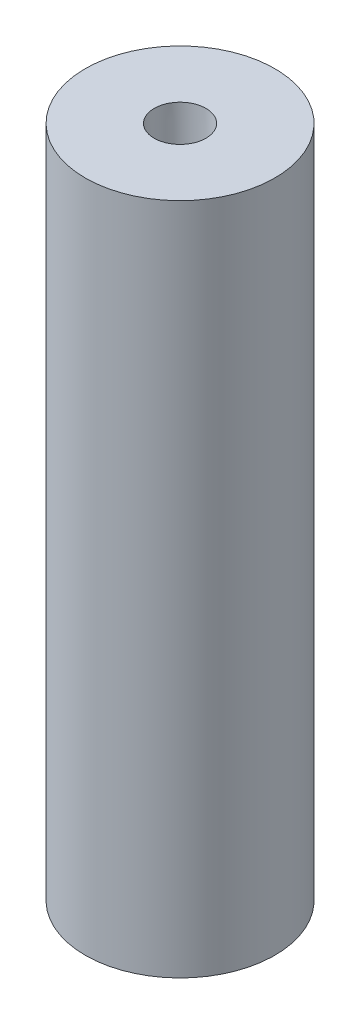
ISO-10303-21;
HEADER;
FILE_DESCRIPTION(('STEP AP214'),'2;1');
FILE_NAME('part.step','',(''),(''),'','','');
FILE_SCHEMA(('AUTOMOTIVE_DESIGN { 1 0 10303 214 1 1 1 1 }'));
ENDSEC;
DATA;
#1=APPLICATION_CONTEXT('core data for automotive mechanical design processes');
#2=APPLICATION_PROTOCOL_DEFINITION('international standard','automotive_design',2000,#1);
#3=PRODUCT_CONTEXT('',#1,'mechanical');
#4=PRODUCT('Part','Part','',(#3));
#5=PRODUCT_RELATED_PRODUCT_CATEGORY('part','',(#4));
#6=PRODUCT_DEFINITION_FORMATION('','',#4);
#7=PRODUCT_DEFINITION_CONTEXT('part definition',#1,'design');
#8=PRODUCT_DEFINITION('design','',#6,#7);
#9=PRODUCT_DEFINITION_SHAPE('','',#8);
#10=(LENGTH_UNIT() NAMED_UNIT(*) SI_UNIT(.MILLI.,.METRE.));
#11=(NAMED_UNIT(*) PLANE_ANGLE_UNIT() SI_UNIT($,.RADIAN.));
#12=(NAMED_UNIT(*) SI_UNIT($,.STERADIAN.) SOLID_ANGLE_UNIT());
#13=UNCERTAINTY_MEASURE_WITH_UNIT(LENGTH_MEASURE(1.E-05),#10,'distance_accuracy_value','');
#14=(GEOMETRIC_REPRESENTATION_CONTEXT(3) GLOBAL_UNCERTAINTY_ASSIGNED_CONTEXT((#13)) GLOBAL_UNIT_ASSIGNED_CONTEXT((#10,
#11,#12)) REPRESENTATION_CONTEXT('',''));
#15=CARTESIAN_POINT('',(0.,0.,0.));
#16=DIRECTION('',(0.,0.,1.));
#17=DIRECTION('',(1.,0.,0.));
#18=AXIS2_PLACEMENT_3D('',#15,#16,#17);
#19=CARTESIAN_POINT('',(0.,65.,0.));
#20=DIRECTION('',(0.,-1.,0.));
#21=DIRECTION('',(0.,0.,-1.));
#22=AXIS2_PLACEMENT_3D('',#19,#20,#21);
#23=CYLINDRICAL_SURFACE('',#22,9.15);
#24=CARTESIAN_POINT('',(0.,65.,0.));
#25=DIRECTION('',(0.,1.,0.));
#26=DIRECTION('',(0.,0.,1.));
#27=AXIS2_PLACEMENT_3D('',#24,#25,#26);
#28=CIRCLE('',#27,9.15);
#29=CARTESIAN_POINT('',(0.,65.,9.15));
#30=VERTEX_POINT('',#29);
#31=EDGE_CURVE('E50',#30,#30,#28,.T.);
#32=ORIENTED_EDGE('',*,*,#31,.F.);
#33=EDGE_LOOP('',(#32));
#34=FACE_BOUND('',#33,.T.);
#35=CARTESIAN_POINT('',(0.,0.,0.));
#36=DIRECTION('',(0.,1.,0.));
#37=DIRECTION('',(0.,0.,1.));
#38=AXIS2_PLACEMENT_3D('',#35,#36,#37);
#39=CIRCLE('',#38,9.15);
#40=CARTESIAN_POINT('',(0.,0.,9.15));
#41=VERTEX_POINT('',#40);
#42=EDGE_CURVE('E54',#41,#41,#39,.T.);
#43=ORIENTED_EDGE('',*,*,#42,.T.);
#44=EDGE_LOOP('',(#43));
#45=FACE_BOUND('',#44,.T.);
#46=ADVANCED_FACE('F38',(#34,#45),#23,.T.);
#47=CARTESIAN_POINT('',(0.,65.,0.));
#48=DIRECTION('',(0.,1.,0.));
#49=DIRECTION('',(0.,0.,1.));
#50=AXIS2_PLACEMENT_3D('',#47,#48,#49);
#51=PLANE('',#50);
#52=CARTESIAN_POINT('',(0.,65.,0.));
#53=DIRECTION('',(0.,1.,0.));
#54=DIRECTION('',(0.,0.,1.));
#55=AXIS2_PLACEMENT_3D('',#52,#53,#54);
#56=CIRCLE('',#55,2.5);
#57=CARTESIAN_POINT('',(0.,65.,2.5));
#58=VERTEX_POINT('',#57);
#59=EDGE_CURVE('E58',#58,#58,#56,.T.);
#60=ORIENTED_EDGE('',*,*,#59,.F.);
#61=EDGE_LOOP('',(#60));
#62=FACE_BOUND('',#61,.T.);
#63=ORIENTED_EDGE('',*,*,#31,.T.);
#64=EDGE_LOOP('',(#63));
#65=FACE_BOUND('',#64,.T.);
#66=ADVANCED_FACE('F72',(#62,#65),#51,.T.);
#67=CARTESIAN_POINT('',(0.,0.,0.));
#68=DIRECTION('',(0.,1.,0.));
#69=DIRECTION('',(0.,0.,1.));
#70=AXIS2_PLACEMENT_3D('',#67,#68,#69);
#71=PLANE('',#70);
#72=CARTESIAN_POINT('',(0.,0.,0.));
#73=DIRECTION('',(0.,-1.,0.));
#74=DIRECTION('',(0.,0.,-1.));
#75=AXIS2_PLACEMENT_3D('',#72,#73,#74);
#76=CIRCLE('',#75,2.5);
#77=CARTESIAN_POINT('',(0.,0.,-2.5));
#78=VERTEX_POINT('',#77);
#79=EDGE_CURVE('E62',#78,#78,#76,.T.);
#80=ORIENTED_EDGE('',*,*,#79,.F.);
#81=EDGE_LOOP('',(#80));
#82=FACE_BOUND('',#81,.T.);
#83=ORIENTED_EDGE('',*,*,#42,.F.);
#84=EDGE_LOOP('',(#83));
#85=FACE_BOUND('',#84,.T.);
#86=ADVANCED_FACE('F68',(#82,#85),#71,.F.);
#87=CARTESIAN_POINT('',(0.,55.,0.));
#88=DIRECTION('',(0.,1.,0.));
#89=DIRECTION('',(0.,0.,1.));
#90=AXIS2_PLACEMENT_3D('',#87,#88,#89);
#91=PLANE('',#90);
#92=CARTESIAN_POINT('',(0.,55.,0.));
#93=DIRECTION('',(0.,1.,0.));
#94=DIRECTION('',(0.,0.,1.));
#95=AXIS2_PLACEMENT_3D('',#92,#93,#94);
#96=CIRCLE('',#95,2.24999999999973);
#97=CARTESIAN_POINT('',(0.,55.,2.24999999999973));
#98=VERTEX_POINT('',#97);
#99=EDGE_CURVE('E46',#98,#98,#96,.T.);
#100=ORIENTED_EDGE('',*,*,#99,.T.);
#101=EDGE_LOOP('',(#100));
#102=FACE_BOUND('',#101,.T.);
#103=ADVANCED_FACE('F71',(#102),#91,.T.);
#104=CARTESIAN_POINT('',(0.,55.,0.));
#105=DIRECTION('',(0.,1.,0.));
#106=DIRECTION('',(0.,0.,1.));
#107=AXIS2_PLACEMENT_3D('',#104,#105,#106);
#108=CONICAL_SURFACE('',#107,2.24999999999973,0.0249947936189236);
#109=ORIENTED_EDGE('',*,*,#59,.T.);
#110=EDGE_LOOP('',(#109));
#111=FACE_BOUND('',#110,.T.);
#112=ORIENTED_EDGE('',*,*,#99,.F.);
#113=EDGE_LOOP('',(#112));
#114=FACE_BOUND('',#113,.T.);
#115=ADVANCED_FACE('F86',(#111,#114),#108,.F.);
#116=CARTESIAN_POINT('',(0.,10.,0.));
#117=DIRECTION('',(0.,-1.,0.));
#118=DIRECTION('',(0.,0.,-1.));
#119=AXIS2_PLACEMENT_3D('',#116,#117,#118);
#120=PLANE('',#119);
#121=CARTESIAN_POINT('',(0.,10.,0.));
#122=DIRECTION('',(0.,-1.,0.));
#123=DIRECTION('',(0.,0.,-1.));
#124=AXIS2_PLACEMENT_3D('',#121,#122,#123);
#125=CIRCLE('',#124,2.24999999999973);
#126=CARTESIAN_POINT('',(0.,10.,-2.24999999999973));
#127=VERTEX_POINT('',#126);
#128=EDGE_CURVE('E10',#127,#127,#125,.T.);
#129=ORIENTED_EDGE('',*,*,#128,.T.);
#130=EDGE_LOOP('',(#129));
#131=FACE_BOUND('',#130,.T.);
#132=ADVANCED_FACE('F90',(#131),#120,.T.);
#133=CARTESIAN_POINT('',(0.,10.,0.));
#134=DIRECTION('',(0.,-1.,0.));
#135=DIRECTION('',(0.,0.,-1.));
#136=AXIS2_PLACEMENT_3D('',#133,#134,#135);
#137=CONICAL_SURFACE('',#136,2.24999999999973,0.0249947936189236);
#138=ORIENTED_EDGE('',*,*,#79,.T.);
#139=EDGE_LOOP('',(#138));
#140=FACE_BOUND('',#139,.T.);
#141=ORIENTED_EDGE('',*,*,#128,.F.);
#142=EDGE_LOOP('',(#141));
#143=FACE_BOUND('',#142,.T.);
#144=ADVANCED_FACE('F41',(#140,#143),#137,.F.);
#145=CLOSED_SHELL('',(#46,#66,#86,#103,#115,#132,#144));
#146=MANIFOLD_SOLID_BREP('B2',#145);
#147=ADVANCED_BREP_SHAPE_REPRESENTATION('',(#18,#146),#14);
#148=SHAPE_DEFINITION_REPRESENTATION(#9,#147);
ENDSEC;
END-ISO-10303-21;
